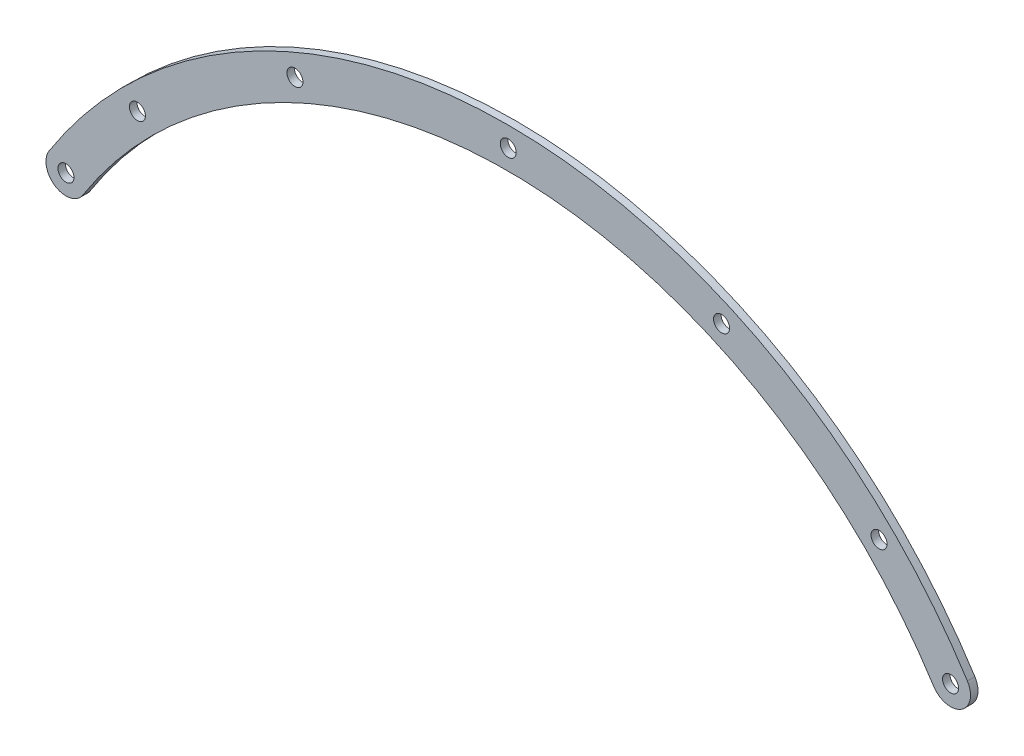
ISO-10303-21;
HEADER;
FILE_DESCRIPTION(('STEP AP214'),'2;1');
FILE_NAME('part.step','',(''),(''),'','','');
FILE_SCHEMA(('AUTOMOTIVE_DESIGN { 1 0 10303 214 1 1 1 1 }'));
ENDSEC;
DATA;
#1=APPLICATION_CONTEXT('core data for automotive mechanical design processes');
#2=APPLICATION_PROTOCOL_DEFINITION('international standard','automotive_design',2000,#1);
#3=PRODUCT_CONTEXT('',#1,'mechanical');
#4=PRODUCT('Part','Part','',(#3));
#5=PRODUCT_RELATED_PRODUCT_CATEGORY('part','',(#4));
#6=PRODUCT_DEFINITION_FORMATION('','',#4);
#7=PRODUCT_DEFINITION_CONTEXT('part definition',#1,'design');
#8=PRODUCT_DEFINITION('design','',#6,#7);
#9=PRODUCT_DEFINITION_SHAPE('','',#8);
#10=(LENGTH_UNIT() NAMED_UNIT(*) SI_UNIT(.MILLI.,.METRE.));
#11=(NAMED_UNIT(*) PLANE_ANGLE_UNIT() SI_UNIT($,.RADIAN.));
#12=(NAMED_UNIT(*) SI_UNIT($,.STERADIAN.) SOLID_ANGLE_UNIT());
#13=UNCERTAINTY_MEASURE_WITH_UNIT(LENGTH_MEASURE(1.E-05),#10,'distance_accuracy_value','');
#14=(GEOMETRIC_REPRESENTATION_CONTEXT(3) GLOBAL_UNCERTAINTY_ASSIGNED_CONTEXT((#13)) GLOBAL_UNIT_ASSIGNED_CONTEXT((#10,
#11,#12)) REPRESENTATION_CONTEXT('',''));
#15=CARTESIAN_POINT('',(0.,0.,0.));
#16=DIRECTION('',(0.,0.,1.));
#17=DIRECTION('',(1.,0.,0.));
#18=AXIS2_PLACEMENT_3D('',#15,#16,#17);
#19=CARTESIAN_POINT('',(-88.556101810353,56.4164588764165,1.5));
#20=DIRECTION('',(0.,0.,-1.));
#21=DIRECTION('',(-1.,0.,0.));
#22=AXIS2_PLACEMENT_3D('',#19,#20,#21);
#23=CYLINDRICAL_SURFACE('',#22,4.00000000000002);
#24=DIRECTION('',(0.,0.,-1.));
#25=VECTOR('',#24,1.);
#26=CARTESIAN_POINT('',(-85.1825360271014,54.2672604430292,5.));
#27=LINE('',#26,#25);
#28=CARTESIAN_POINT('',(-85.1825360271014,54.2672604430292,0.));
#29=VERTEX_POINT('',#28);
#30=CARTESIAN_POINT('',(-85.1825360271014,54.2672604430292,1.5));
#31=VERTEX_POINT('',#30);
#32=EDGE_CURVE('E71',#29,#31,#27,.F.);
#33=ORIENTED_EDGE('',*,*,#32,.T.);
#34=CARTESIAN_POINT('',(-88.556101810353,56.4164588764165,1.5));
#35=DIRECTION('',(0.,0.,-1.));
#36=DIRECTION('',(-1.,0.,0.));
#37=AXIS2_PLACEMENT_3D('',#34,#35,#36);
#38=CIRCLE('',#37,4.00000000000002);
#39=CARTESIAN_POINT('',(-91.9296675936045,58.5656573098038,1.5));
#40=VERTEX_POINT('',#39);
#41=EDGE_CURVE('E105',#40,#31,#38,.F.);
#42=ORIENTED_EDGE('',*,*,#41,.F.);
#43=DIRECTION('',(0.,0.,-1.));
#44=VECTOR('',#43,1.);
#45=CARTESIAN_POINT('',(-91.9296675936045,58.5656573098038,5.));
#46=LINE('',#45,#44);
#47=CARTESIAN_POINT('',(-91.9296675936045,58.5656573098038,0.));
#48=VERTEX_POINT('',#47);
#49=EDGE_CURVE('E74',#40,#48,#46,.T.);
#50=ORIENTED_EDGE('',*,*,#49,.T.);
#51=CARTESIAN_POINT('',(-88.556101810353,56.4164588764165,0.));
#52=DIRECTION('',(0.,0.,-1.));
#53=DIRECTION('',(-1.,0.,0.));
#54=AXIS2_PLACEMENT_3D('',#51,#52,#53);
#55=CIRCLE('',#54,4.00000000000002);
#56=EDGE_CURVE('E35',#48,#29,#55,.F.);
#57=ORIENTED_EDGE('',*,*,#56,.T.);
#58=EDGE_LOOP('',(#33,#42,#50,#57));
#59=FACE_BOUND('',#58,.T.);
#60=ADVANCED_FACE('F32',(#59),#23,.T.);
#61=CARTESIAN_POINT('',(0.,0.,1.5));
#62=DIRECTION('',(0.,0.,-1.));
#63=DIRECTION('',(-1.,0.,0.));
#64=AXIS2_PLACEMENT_3D('',#61,#62,#63);
#65=CYLINDRICAL_SURFACE('',#64,101.);
#66=DIRECTION('',(0.,0.,-1.));
#67=VECTOR('',#66,1.);
#68=CARTESIAN_POINT('',(85.1825360271014,54.2672604430293,5.));
#69=LINE('',#68,#67);
#70=CARTESIAN_POINT('',(85.1825360271014,54.2672604430293,1.5));
#71=VERTEX_POINT('',#70);
#72=CARTESIAN_POINT('',(85.1825360271014,54.2672604430293,0.));
#73=VERTEX_POINT('',#72);
#74=EDGE_CURVE('E80',#71,#73,#69,.T.);
#75=ORIENTED_EDGE('',*,*,#74,.F.);
#76=CARTESIAN_POINT('',(0.,0.,1.5));
#77=DIRECTION('',(0.,0.,-1.));
#78=DIRECTION('',(-1.,0.,0.));
#79=AXIS2_PLACEMENT_3D('',#76,#77,#78);
#80=CIRCLE('',#79,101.);
#81=EDGE_CURVE('E85',#31,#71,#80,.T.);
#82=ORIENTED_EDGE('',*,*,#81,.F.);
#83=ORIENTED_EDGE('',*,*,#32,.F.);
#84=CARTESIAN_POINT('',(0.,0.,0.));
#85=DIRECTION('',(0.,0.,-1.));
#86=DIRECTION('',(-1.,0.,0.));
#87=AXIS2_PLACEMENT_3D('',#84,#85,#86);
#88=CIRCLE('',#87,101.);
#89=EDGE_CURVE('E79',#29,#73,#88,.T.);
#90=ORIENTED_EDGE('',*,*,#89,.T.);
#91=EDGE_LOOP('',(#75,#82,#83,#90));
#92=FACE_BOUND('',#91,.T.);
#93=ADVANCED_FACE('F82',(#92),#65,.F.);
#94=CARTESIAN_POINT('',(88.556101810353,56.4164588764165,1.5));
#95=DIRECTION('',(0.,0.,-1.));
#96=DIRECTION('',(-1.,0.,0.));
#97=AXIS2_PLACEMENT_3D('',#94,#95,#96);
#98=CYLINDRICAL_SURFACE('',#97,4.);
#99=CARTESIAN_POINT('',(88.556101810353,56.4164588764165,1.5));
#100=DIRECTION('',(0.,0.,-1.));
#101=DIRECTION('',(-1.,0.,0.));
#102=AXIS2_PLACEMENT_3D('',#99,#100,#101);
#103=CIRCLE('',#102,4.);
#104=CARTESIAN_POINT('',(91.9296675936045,58.5656573098038,1.5));
#105=VERTEX_POINT('',#104);
#106=EDGE_CURVE('E108',#71,#105,#103,.F.);
#107=ORIENTED_EDGE('',*,*,#106,.F.);
#108=ORIENTED_EDGE('',*,*,#74,.T.);
#109=CARTESIAN_POINT('',(88.556101810353,56.4164588764165,0.));
#110=DIRECTION('',(0.,0.,-1.));
#111=DIRECTION('',(-1.,0.,0.));
#112=AXIS2_PLACEMENT_3D('',#109,#110,#111);
#113=CIRCLE('',#112,4.);
#114=CARTESIAN_POINT('',(91.9296675936045,58.5656573098038,0.));
#115=VERTEX_POINT('',#114);
#116=EDGE_CURVE('E90',#73,#115,#113,.F.);
#117=ORIENTED_EDGE('',*,*,#116,.T.);
#118=DIRECTION('',(0.,0.,-1.));
#119=VECTOR('',#118,1.);
#120=CARTESIAN_POINT('',(91.9296675936045,58.5656573098038,5.));
#121=LINE('',#120,#119);
#122=EDGE_CURVE('E50',#115,#105,#121,.F.);
#123=ORIENTED_EDGE('',*,*,#122,.T.);
#124=EDGE_LOOP('',(#107,#108,#117,#123));
#125=FACE_BOUND('',#124,.T.);
#126=ADVANCED_FACE('F167',(#125),#98,.T.);
#127=CARTESIAN_POINT('',(-42.707347522959,95.9222730524731,1.5));
#128=DIRECTION('',(0.,0.,-1.));
#129=DIRECTION('',(-1.,0.,0.));
#130=AXIS2_PLACEMENT_3D('',#127,#128,#129);
#131=CYLINDRICAL_SURFACE('',#130,1.6);
#132=CARTESIAN_POINT('',(-42.707347522959,95.9222730524731,1.5));
#133=DIRECTION('',(0.,0.,-1.));
#134=DIRECTION('',(-1.,0.,0.));
#135=AXIS2_PLACEMENT_3D('',#132,#133,#134);
#136=CIRCLE('',#135,1.6);
#137=CARTESIAN_POINT('',(-44.307347522959,95.9222730524731,1.5));
#138=VERTEX_POINT('',#137);
#139=EDGE_CURVE('E110',#138,#138,#136,.T.);
#140=ORIENTED_EDGE('',*,*,#139,.F.);
#141=EDGE_LOOP('',(#140));
#142=FACE_BOUND('',#141,.T.);
#143=CARTESIAN_POINT('',(-42.707347522959,95.9222730524731,0.));
#144=DIRECTION('',(0.,0.,-1.));
#145=DIRECTION('',(-1.,0.,0.));
#146=AXIS2_PLACEMENT_3D('',#143,#144,#145);
#147=CIRCLE('',#146,1.6);
#148=CARTESIAN_POINT('',(-44.307347522959,95.9222730524731,0.));
#149=VERTEX_POINT('',#148);
#150=EDGE_CURVE('E91',#149,#149,#147,.T.);
#151=ORIENTED_EDGE('',*,*,#150,.T.);
#152=EDGE_LOOP('',(#151));
#153=FACE_BOUND('',#152,.T.);
#154=ADVANCED_FACE('F169',(#142,#153),#131,.F.);
#155=CARTESIAN_POINT('',(42.707347522959,95.9222730524731,1.5));
#156=DIRECTION('',(0.,0.,-1.));
#157=DIRECTION('',(-1.,0.,0.));
#158=AXIS2_PLACEMENT_3D('',#155,#156,#157);
#159=CYLINDRICAL_SURFACE('',#158,1.6);
#160=CARTESIAN_POINT('',(42.707347522959,95.9222730524731,1.5));
#161=DIRECTION('',(0.,0.,-1.));
#162=DIRECTION('',(-1.,0.,0.));
#163=AXIS2_PLACEMENT_3D('',#160,#161,#162);
#164=CIRCLE('',#163,1.6);
#165=CARTESIAN_POINT('',(41.107347522959,95.9222730524731,1.5));
#166=VERTEX_POINT('',#165);
#167=EDGE_CURVE('E113',#166,#166,#164,.T.);
#168=ORIENTED_EDGE('',*,*,#167,.F.);
#169=EDGE_LOOP('',(#168));
#170=FACE_BOUND('',#169,.T.);
#171=CARTESIAN_POINT('',(42.707347522959,95.9222730524731,0.));
#172=DIRECTION('',(0.,0.,-1.));
#173=DIRECTION('',(-1.,0.,0.));
#174=AXIS2_PLACEMENT_3D('',#171,#172,#173);
#175=CIRCLE('',#174,1.6);
#176=CARTESIAN_POINT('',(41.107347522959,95.9222730524731,0.));
#177=VERTEX_POINT('',#176);
#178=EDGE_CURVE('E96',#177,#177,#175,.T.);
#179=ORIENTED_EDGE('',*,*,#178,.T.);
#180=EDGE_LOOP('',(#179));
#181=FACE_BOUND('',#180,.T.);
#182=ADVANCED_FACE('F175',(#170,#181),#159,.F.);
#183=CARTESIAN_POINT('',(88.556101810353,56.4164588764165,1.5));
#184=DIRECTION('',(0.,0.,-1.));
#185=DIRECTION('',(-1.,0.,0.));
#186=AXIS2_PLACEMENT_3D('',#183,#184,#185);
#187=CYLINDRICAL_SURFACE('',#186,1.6);
#188=CARTESIAN_POINT('',(88.556101810353,56.4164588764165,1.5));
#189=DIRECTION('',(0.,0.,-1.));
#190=DIRECTION('',(-1.,0.,0.));
#191=AXIS2_PLACEMENT_3D('',#188,#189,#190);
#192=CIRCLE('',#191,1.6);
#193=CARTESIAN_POINT('',(86.956101810353,56.4164588764165,1.5));
#194=VERTEX_POINT('',#193);
#195=EDGE_CURVE('E116',#194,#194,#192,.T.);
#196=ORIENTED_EDGE('',*,*,#195,.F.);
#197=EDGE_LOOP('',(#196));
#198=FACE_BOUND('',#197,.T.);
#199=CARTESIAN_POINT('',(88.556101810353,56.4164588764165,0.));
#200=DIRECTION('',(0.,0.,-1.));
#201=DIRECTION('',(-1.,0.,0.));
#202=AXIS2_PLACEMENT_3D('',#199,#200,#201);
#203=CIRCLE('',#202,1.6);
#204=CARTESIAN_POINT('',(86.956101810353,56.4164588764165,0.));
#205=VERTEX_POINT('',#204);
#206=EDGE_CURVE('E99',#205,#205,#203,.T.);
#207=ORIENTED_EDGE('',*,*,#206,.T.);
#208=EDGE_LOOP('',(#207));
#209=FACE_BOUND('',#208,.T.);
#210=ADVANCED_FACE('F195',(#198,#209),#187,.F.);
#211=CARTESIAN_POINT('',(-88.556101810353,56.4164588764165,1.5));
#212=DIRECTION('',(0.,0.,-1.));
#213=DIRECTION('',(-1.,0.,0.));
#214=AXIS2_PLACEMENT_3D('',#211,#212,#213);
#215=CYLINDRICAL_SURFACE('',#214,1.6);
#216=CARTESIAN_POINT('',(-88.556101810353,56.4164588764165,1.5));
#217=DIRECTION('',(0.,0.,-1.));
#218=DIRECTION('',(-1.,0.,0.));
#219=AXIS2_PLACEMENT_3D('',#216,#217,#218);
#220=CIRCLE('',#219,1.6);
#221=CARTESIAN_POINT('',(-90.156101810353,56.4164588764165,1.5));
#222=VERTEX_POINT('',#221);
#223=EDGE_CURVE('E119',#222,#222,#220,.T.);
#224=ORIENTED_EDGE('',*,*,#223,.F.);
#225=EDGE_LOOP('',(#224));
#226=FACE_BOUND('',#225,.T.);
#227=CARTESIAN_POINT('',(-88.556101810353,56.4164588764165,0.));
#228=DIRECTION('',(0.,0.,-1.));
#229=DIRECTION('',(-1.,0.,0.));
#230=AXIS2_PLACEMENT_3D('',#227,#228,#229);
#231=CIRCLE('',#230,1.6);
#232=CARTESIAN_POINT('',(-90.156101810353,56.4164588764165,0.));
#233=VERTEX_POINT('',#232);
#234=EDGE_CURVE('E102',#233,#233,#231,.T.);
#235=ORIENTED_EDGE('',*,*,#234,.T.);
#236=EDGE_LOOP('',(#235));
#237=FACE_BOUND('',#236,.T.);
#238=ADVANCED_FACE('F191',(#226,#237),#215,.F.);
#239=CARTESIAN_POINT('',(0.,0.,0.));
#240=DIRECTION('',(0.,0.,1.));
#241=DIRECTION('',(1.,0.,0.));
#242=AXIS2_PLACEMENT_3D('',#239,#240,#241);
#243=PLANE('',#242);
#244=CARTESIAN_POINT('',(0.,105.,0.));
#245=DIRECTION('',(0.,0.,1.));
#246=DIRECTION('',(1.,0.,0.));
#247=AXIS2_PLACEMENT_3D('',#244,#245,#246);
#248=CIRCLE('',#247,1.6);
#249=CARTESIAN_POINT('',(1.6,105.,0.));
#250=VERTEX_POINT('',#249);
#251=EDGE_CURVE('E132',#250,#250,#248,.T.);
#252=ORIENTED_EDGE('',*,*,#251,.T.);
#253=EDGE_LOOP('',(#252));
#254=FACE_BOUND('',#253,.T.);
#255=CARTESIAN_POINT('',(74.2462120245874,74.2462120245876,0.));
#256=DIRECTION('',(0.,0.,1.));
#257=DIRECTION('',(1.,0.,0.));
#258=AXIS2_PLACEMENT_3D('',#255,#256,#257);
#259=CIRCLE('',#258,1.60000000000001);
#260=CARTESIAN_POINT('',(75.8462120245874,74.2462120245876,0.));
#261=VERTEX_POINT('',#260);
#262=EDGE_CURVE('E135',#261,#261,#259,.T.);
#263=ORIENTED_EDGE('',*,*,#262,.T.);
#264=EDGE_LOOP('',(#263));
#265=FACE_BOUND('',#264,.T.);
#266=CARTESIAN_POINT('',(-74.2462120245876,74.2462120245874,0.));
#267=DIRECTION('',(0.,0.,1.));
#268=DIRECTION('',(1.,0.,0.));
#269=AXIS2_PLACEMENT_3D('',#266,#267,#268);
#270=CIRCLE('',#269,1.60000000000001);
#271=CARTESIAN_POINT('',(-72.6462120245876,74.2462120245874,0.));
#272=VERTEX_POINT('',#271);
#273=EDGE_CURVE('E123',#272,#272,#270,.T.);
#274=ORIENTED_EDGE('',*,*,#273,.T.);
#275=EDGE_LOOP('',(#274));
#276=FACE_BOUND('',#275,.T.);
#277=ORIENTED_EDGE('',*,*,#234,.F.);
#278=EDGE_LOOP('',(#277));
#279=FACE_BOUND('',#278,.T.);
#280=ORIENTED_EDGE('',*,*,#206,.F.);
#281=EDGE_LOOP('',(#280));
#282=FACE_BOUND('',#281,.T.);
#283=ORIENTED_EDGE('',*,*,#178,.F.);
#284=EDGE_LOOP('',(#283));
#285=FACE_BOUND('',#284,.T.);
#286=ORIENTED_EDGE('',*,*,#150,.F.);
#287=EDGE_LOOP('',(#286));
#288=FACE_BOUND('',#287,.T.);
#289=ORIENTED_EDGE('',*,*,#116,.F.);
#290=ORIENTED_EDGE('',*,*,#89,.F.);
#291=ORIENTED_EDGE('',*,*,#56,.F.);
#292=CARTESIAN_POINT('',(0.,0.,0.));
#293=DIRECTION('',(0.,0.,-1.));
#294=DIRECTION('',(-1.,0.,0.));
#295=AXIS2_PLACEMENT_3D('',#292,#293,#294);
#296=CIRCLE('',#295,109.);
#297=EDGE_CURVE('E41',#115,#48,#296,.F.);
#298=ORIENTED_EDGE('',*,*,#297,.F.);
#299=EDGE_LOOP('',(#289,#290,#291,#298));
#300=FACE_BOUND('',#299,.T.);
#301=ADVANCED_FACE('F89',(#254,#265,#276,#279,#282,#285,#288,#300),#243,.F.);
#302=CARTESIAN_POINT('',(0.,0.,1.5));
#303=DIRECTION('',(0.,0.,1.));
#304=DIRECTION('',(1.,0.,0.));
#305=AXIS2_PLACEMENT_3D('',#302,#303,#304);
#306=PLANE('',#305);
#307=CARTESIAN_POINT('',(0.,105.,1.5));
#308=DIRECTION('',(0.,0.,1.));
#309=DIRECTION('',(1.,0.,0.));
#310=AXIS2_PLACEMENT_3D('',#307,#308,#309);
#311=CIRCLE('',#310,1.6);
#312=CARTESIAN_POINT('',(1.6,105.,1.5));
#313=VERTEX_POINT('',#312);
#314=EDGE_CURVE('E138',#313,#313,#311,.T.);
#315=ORIENTED_EDGE('',*,*,#314,.F.);
#316=EDGE_LOOP('',(#315));
#317=FACE_BOUND('',#316,.T.);
#318=CARTESIAN_POINT('',(74.2462120245874,74.2462120245876,1.5));
#319=DIRECTION('',(0.,0.,1.));
#320=DIRECTION('',(1.,0.,0.));
#321=AXIS2_PLACEMENT_3D('',#318,#319,#320);
#322=CIRCLE('',#321,1.60000000000001);
#323=CARTESIAN_POINT('',(75.8462120245874,74.2462120245876,1.5));
#324=VERTEX_POINT('',#323);
#325=EDGE_CURVE('E139',#324,#324,#322,.T.);
#326=ORIENTED_EDGE('',*,*,#325,.F.);
#327=EDGE_LOOP('',(#326));
#328=FACE_BOUND('',#327,.T.);
#329=CARTESIAN_POINT('',(-74.2462120245876,74.2462120245874,1.5));
#330=DIRECTION('',(0.,0.,1.));
#331=DIRECTION('',(1.,0.,0.));
#332=AXIS2_PLACEMENT_3D('',#329,#330,#331);
#333=CIRCLE('',#332,1.60000000000001);
#334=CARTESIAN_POINT('',(-72.6462120245876,74.2462120245874,1.5));
#335=VERTEX_POINT('',#334);
#336=EDGE_CURVE('E129',#335,#335,#333,.T.);
#337=ORIENTED_EDGE('',*,*,#336,.F.);
#338=EDGE_LOOP('',(#337));
#339=FACE_BOUND('',#338,.T.);
#340=ORIENTED_EDGE('',*,*,#223,.T.);
#341=EDGE_LOOP('',(#340));
#342=FACE_BOUND('',#341,.T.);
#343=ORIENTED_EDGE('',*,*,#195,.T.);
#344=EDGE_LOOP('',(#343));
#345=FACE_BOUND('',#344,.T.);
#346=ORIENTED_EDGE('',*,*,#167,.T.);
#347=EDGE_LOOP('',(#346));
#348=FACE_BOUND('',#347,.T.);
#349=ORIENTED_EDGE('',*,*,#139,.T.);
#350=EDGE_LOOP('',(#349));
#351=FACE_BOUND('',#350,.T.);
#352=ORIENTED_EDGE('',*,*,#81,.T.);
#353=ORIENTED_EDGE('',*,*,#106,.T.);
#354=CARTESIAN_POINT('',(0.,0.,1.5));
#355=DIRECTION('',(0.,0.,-1.));
#356=DIRECTION('',(-1.,0.,0.));
#357=AXIS2_PLACEMENT_3D('',#354,#355,#356);
#358=CIRCLE('',#357,109.);
#359=EDGE_CURVE('E11',#40,#105,#358,.T.);
#360=ORIENTED_EDGE('',*,*,#359,.F.);
#361=ORIENTED_EDGE('',*,*,#41,.T.);
#362=EDGE_LOOP('',(#352,#353,#360,#361));
#363=FACE_BOUND('',#362,.T.);
#364=ADVANCED_FACE('F148',(#317,#328,#339,#342,#345,#348,#351,#363),#306,.T.);
#365=CARTESIAN_POINT('',(0.,0.,1.5));
#366=DIRECTION('',(0.,0.,-1.));
#367=DIRECTION('',(-1.,0.,0.));
#368=AXIS2_PLACEMENT_3D('',#365,#366,#367);
#369=CYLINDRICAL_SURFACE('',#368,109.);
#370=ORIENTED_EDGE('',*,*,#359,.T.);
#371=ORIENTED_EDGE('',*,*,#122,.F.);
#372=ORIENTED_EDGE('',*,*,#297,.T.);
#373=ORIENTED_EDGE('',*,*,#49,.F.);
#374=EDGE_LOOP('',(#370,#371,#372,#373));
#375=FACE_BOUND('',#374,.T.);
#376=ADVANCED_FACE('F151',(#375),#369,.T.);
#377=CARTESIAN_POINT('',(-74.2462120245876,74.2462120245874,-8.5));
#378=DIRECTION('',(0.,0.,1.));
#379=DIRECTION('',(1.,0.,0.));
#380=AXIS2_PLACEMENT_3D('',#377,#378,#379);
#381=CYLINDRICAL_SURFACE('',#380,1.60000000000001);
#382=ORIENTED_EDGE('',*,*,#336,.T.);
#383=EDGE_LOOP('',(#382));
#384=FACE_BOUND('',#383,.T.);
#385=ORIENTED_EDGE('',*,*,#273,.F.);
#386=EDGE_LOOP('',(#385));
#387=FACE_BOUND('',#386,.T.);
#388=ADVANCED_FACE('F179',(#384,#387),#381,.F.);
#389=CARTESIAN_POINT('',(74.2462120245874,74.2462120245876,-8.5));
#390=DIRECTION('',(0.,0.,1.));
#391=DIRECTION('',(1.,0.,0.));
#392=AXIS2_PLACEMENT_3D('',#389,#390,#391);
#393=CYLINDRICAL_SURFACE('',#392,1.60000000000001);
#394=ORIENTED_EDGE('',*,*,#325,.T.);
#395=EDGE_LOOP('',(#394));
#396=FACE_BOUND('',#395,.T.);
#397=ORIENTED_EDGE('',*,*,#262,.F.);
#398=EDGE_LOOP('',(#397));
#399=FACE_BOUND('',#398,.T.);
#400=ADVANCED_FACE('F184',(#396,#399),#393,.F.);
#401=CARTESIAN_POINT('',(0.,105.,-8.5));
#402=DIRECTION('',(0.,0.,1.));
#403=DIRECTION('',(1.,0.,0.));
#404=AXIS2_PLACEMENT_3D('',#401,#402,#403);
#405=CYLINDRICAL_SURFACE('',#404,1.6);
#406=ORIENTED_EDGE('',*,*,#314,.T.);
#407=EDGE_LOOP('',(#406));
#408=FACE_BOUND('',#407,.T.);
#409=ORIENTED_EDGE('',*,*,#251,.F.);
#410=EDGE_LOOP('',(#409));
#411=FACE_BOUND('',#410,.T.);
#412=ADVANCED_FACE('F145',(#408,#411),#405,.F.);
#413=CLOSED_SHELL('',(#60,#93,#126,#154,#182,#210,#238,#301,#364,#376,#388,#400,#412));
#414=MANIFOLD_SOLID_BREP('B2',#413);
#415=ADVANCED_BREP_SHAPE_REPRESENTATION('',(#18,#414),#14);
#416=SHAPE_DEFINITION_REPRESENTATION(#9,#415);
ENDSEC;
END-ISO-10303-21;
